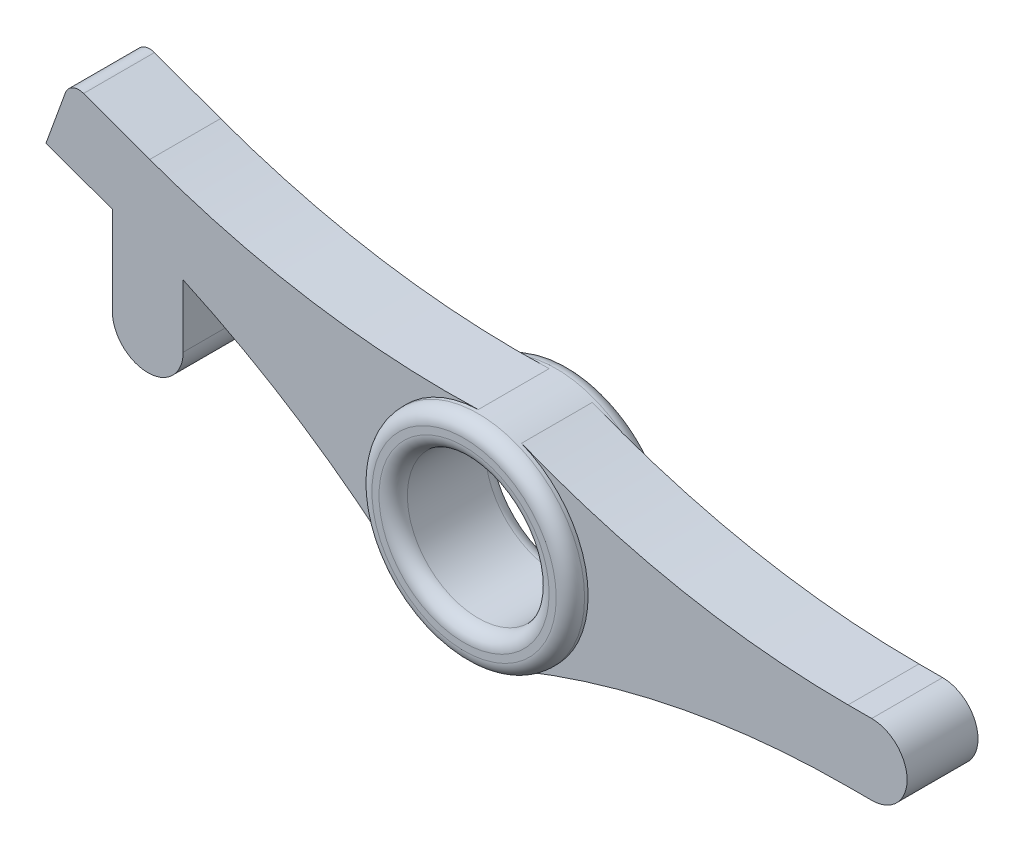
ISO-10303-21;
HEADER;
FILE_DESCRIPTION(('STEP AP214'),'2;1');
FILE_NAME('part.step','',(''),(''),'','','');
FILE_SCHEMA(('AUTOMOTIVE_DESIGN { 1 0 10303 214 1 1 1 1 }'));
ENDSEC;
DATA;
#1=APPLICATION_CONTEXT('core data for automotive mechanical design processes');
#2=APPLICATION_PROTOCOL_DEFINITION('international standard','automotive_design',2000,#1);
#3=PRODUCT_CONTEXT('',#1,'mechanical');
#4=PRODUCT('Part','Part','',(#3));
#5=PRODUCT_RELATED_PRODUCT_CATEGORY('part','',(#4));
#6=PRODUCT_DEFINITION_FORMATION('','',#4);
#7=PRODUCT_DEFINITION_CONTEXT('part definition',#1,'design');
#8=PRODUCT_DEFINITION('design','',#6,#7);
#9=PRODUCT_DEFINITION_SHAPE('','',#8);
#10=(LENGTH_UNIT() NAMED_UNIT(*) SI_UNIT(.MILLI.,.METRE.));
#11=(NAMED_UNIT(*) PLANE_ANGLE_UNIT() SI_UNIT($,.RADIAN.));
#12=(NAMED_UNIT(*) SI_UNIT($,.STERADIAN.) SOLID_ANGLE_UNIT());
#13=UNCERTAINTY_MEASURE_WITH_UNIT(LENGTH_MEASURE(1.E-05),#10,'distance_accuracy_value','');
#14=(GEOMETRIC_REPRESENTATION_CONTEXT(3) GLOBAL_UNCERTAINTY_ASSIGNED_CONTEXT((#13)) GLOBAL_UNIT_ASSIGNED_CONTEXT((#10,
#11,#12)) REPRESENTATION_CONTEXT('',''));
#15=CARTESIAN_POINT('',(0.,0.,0.));
#16=DIRECTION('',(0.,0.,1.));
#17=DIRECTION('',(1.,0.,0.));
#18=AXIS2_PLACEMENT_3D('',#15,#16,#17);
#19=CARTESIAN_POINT('',(55.,0.,5.));
#20=DIRECTION('',(0.,0.,-1.));
#21=DIRECTION('',(-1.,0.,0.));
#22=AXIS2_PLACEMENT_3D('',#19,#20,#21);
#23=CYLINDRICAL_SURFACE('',#22,5.);
#24=DIRECTION('',(0.,0.,1.));
#25=VECTOR('',#24,1.);
#26=CARTESIAN_POINT('',(55.,5.,5.));
#27=LINE('',#26,#25);
#28=CARTESIAN_POINT('',(55.,5.,5.));
#29=VERTEX_POINT('',#28);
#30=CARTESIAN_POINT('',(55.,5.,-5.));
#31=VERTEX_POINT('',#30);
#32=EDGE_CURVE('E170',#29,#31,#27,.F.);
#33=ORIENTED_EDGE('',*,*,#32,.F.);
#34=CARTESIAN_POINT('',(55.,0.,5.));
#35=DIRECTION('',(0.,0.,1.));
#36=DIRECTION('',(1.,0.,0.));
#37=AXIS2_PLACEMENT_3D('',#34,#35,#36);
#38=CIRCLE('',#37,5.);
#39=CARTESIAN_POINT('',(55.,-5.,5.));
#40=VERTEX_POINT('',#39);
#41=EDGE_CURVE('E215',#40,#29,#38,.T.);
#42=ORIENTED_EDGE('',*,*,#41,.F.);
#43=DIRECTION('',(0.,0.,-1.));
#44=VECTOR('',#43,1.);
#45=CARTESIAN_POINT('',(55.,-5.,5.));
#46=LINE('',#45,#44);
#47=CARTESIAN_POINT('',(55.,-5.,-5.));
#48=VERTEX_POINT('',#47);
#49=EDGE_CURVE('E212',#48,#40,#46,.F.);
#50=ORIENTED_EDGE('',*,*,#49,.F.);
#51=CARTESIAN_POINT('',(55.,0.,-5.));
#52=DIRECTION('',(0.,0.,1.));
#53=DIRECTION('',(1.,0.,0.));
#54=AXIS2_PLACEMENT_3D('',#51,#52,#53);
#55=CIRCLE('',#54,5.);
#56=EDGE_CURVE('E218',#31,#48,#55,.F.);
#57=ORIENTED_EDGE('',*,*,#56,.F.);
#58=EDGE_LOOP('',(#33,#42,#50,#57));
#59=FACE_BOUND('',#58,.T.);
#60=ADVANCED_FACE('F39',(#59),#23,.T.);
#61=CARTESIAN_POINT('',(1.71010071662831,4.69846310392955,5.));
#62=DIRECTION('',(-0.342020143325663,-0.93969262078591,0.));
#63=DIRECTION('',(0.939692620785911,-0.342020143325663,0.));
#64=AXIS2_PLACEMENT_3D('',#61,#62,#63);
#65=PLANE('',#64);
#66=DIRECTION('',(-0.939692620785911,0.342020143325663,0.));
#67=VECTOR('',#66,1.);
#68=CARTESIAN_POINT('',(1.71010071662831,4.69846310392955,-5.));
#69=LINE('',#68,#67);
#70=CARTESIAN_POINT('',(-46.8457365386786,22.3713425647349,-5.));
#71=VERTEX_POINT('',#70);
#72=CARTESIAN_POINT('',(-56.1788458498622,25.7683165471584,-5.));
#73=VERTEX_POINT('',#72);
#74=EDGE_CURVE('E187',#71,#73,#69,.T.);
#75=ORIENTED_EDGE('',*,*,#74,.T.);
#76=DIRECTION('',(0.,0.,-1.));
#77=VECTOR('',#76,1.);
#78=CARTESIAN_POINT('',(-56.1788458498622,25.7683165471584,5.));
#79=LINE('',#78,#77);
#80=CARTESIAN_POINT('',(-56.1788458498622,25.7683165471584,5.));
#81=VERTEX_POINT('',#80);
#82=EDGE_CURVE('E47',#73,#81,#79,.F.);
#83=ORIENTED_EDGE('',*,*,#82,.T.);
#84=DIRECTION('',(-0.939692620785911,0.342020143325663,0.));
#85=VECTOR('',#84,1.);
#86=CARTESIAN_POINT('',(1.71010071662831,4.69846310392955,5.));
#87=LINE('',#86,#85);
#88=CARTESIAN_POINT('',(-46.8457365386786,22.3713425647349,5.));
#89=VERTEX_POINT('',#88);
#90=EDGE_CURVE('E161',#89,#81,#87,.T.);
#91=ORIENTED_EDGE('',*,*,#90,.F.);
#92=DIRECTION('',(0.,0.,1.));
#93=VECTOR('',#92,1.);
#94=CARTESIAN_POINT('',(-46.8457365386786,22.3713425647349,-5.));
#95=LINE('',#94,#93);
#96=EDGE_CURVE('E238',#89,#71,#95,.F.);
#97=ORIENTED_EDGE('',*,*,#96,.T.);
#98=EDGE_LOOP('',(#75,#83,#91,#97));
#99=FACE_BOUND('',#98,.T.);
#100=ADVANCED_FACE('F363',(#99),#65,.F.);
#101=CARTESIAN_POINT('',(-59.7683318080624,21.7538937298801,5.));
#102=DIRECTION('',(0.939692620785911,-0.342020143325662,0.));
#103=DIRECTION('',(0.342020143325662,0.939692620785911,0.));
#104=AXIS2_PLACEMENT_3D('',#101,#102,#103);
#105=PLANE('',#104);
#106=DIRECTION('',(-0.342020143325662,-0.939692620785911,0.));
#107=VECTOR('',#106,1.);
#108=CARTESIAN_POINT('',(-59.7683318080624,21.7538937298801,5.));
#109=LINE('',#108,#107);
#110=CARTESIAN_POINT('',(-58.7422713780854,24.5729715922379,5.));
#111=VERTEX_POINT('',#110);
#112=CARTESIAN_POINT('',(-61.4784325246907,17.0554306259506,5.));
#113=VERTEX_POINT('',#112);
#114=EDGE_CURVE('E152',#111,#113,#109,.T.);
#115=ORIENTED_EDGE('',*,*,#114,.F.);
#116=DIRECTION('',(0.,0.,-1.));
#117=VECTOR('',#116,1.);
#118=CARTESIAN_POINT('',(-58.7422713780854,24.5729715922379,5.));
#119=LINE('',#118,#117);
#120=CARTESIAN_POINT('',(-58.7422713780854,24.5729715922379,-5.));
#121=VERTEX_POINT('',#120);
#122=EDGE_CURVE('E285',#111,#121,#119,.T.);
#123=ORIENTED_EDGE('',*,*,#122,.T.);
#124=DIRECTION('',(-0.342020143325662,-0.939692620785911,0.));
#125=VECTOR('',#124,1.);
#126=CARTESIAN_POINT('',(-59.7683318080624,21.7538937298801,-5.));
#127=LINE('',#126,#125);
#128=CARTESIAN_POINT('',(-61.4784325246907,17.0554306259506,-5.));
#129=VERTEX_POINT('',#128);
#130=EDGE_CURVE('E166',#121,#129,#127,.T.);
#131=ORIENTED_EDGE('',*,*,#130,.T.);
#132=DIRECTION('',(0.,0.,-1.));
#133=VECTOR('',#132,1.);
#134=CARTESIAN_POINT('',(-61.4784325246907,17.0554306259506,5.));
#135=LINE('',#134,#133);
#136=EDGE_CURVE('E164',#113,#129,#135,.T.);
#137=ORIENTED_EDGE('',*,*,#136,.F.);
#138=EDGE_LOOP('',(#115,#123,#131,#137));
#139=FACE_BOUND('',#138,.T.);
#140=ADVANCED_FACE('F165',(#139),#105,.F.);
#141=CARTESIAN_POINT('',(-1.71010071662832,-4.69846310392956,5.));
#142=DIRECTION('',(-0.342020143325663,-0.93969262078591,0.));
#143=DIRECTION('',(0.939692620785911,-0.342020143325663,0.));
#144=AXIS2_PLACEMENT_3D('',#141,#142,#143);
#145=PLANE('',#144);
#146=DIRECTION('',(-0.939692620785911,0.342020143325663,0.));
#147=VECTOR('',#146,1.);
#148=CARTESIAN_POINT('',(-1.71010071662832,-4.69846310392956,-5.));
#149=LINE('',#148,#147);
#150=CARTESIAN_POINT('',(-52.12,13.6492397475745,-5.));
#151=VERTEX_POINT('',#150);
#152=EDGE_CURVE('E191',#151,#129,#149,.T.);
#153=ORIENTED_EDGE('',*,*,#152,.F.);
#154=DIRECTION('',(0.,0.,-1.));
#155=VECTOR('',#154,1.);
#156=CARTESIAN_POINT('',(-52.12,13.6492397475745,5.));
#157=LINE('',#156,#155);
#158=CARTESIAN_POINT('',(-52.12,13.6492397475745,5.));
#159=VERTEX_POINT('',#158);
#160=EDGE_CURVE('E171',#159,#151,#157,.T.);
#161=ORIENTED_EDGE('',*,*,#160,.F.);
#162=DIRECTION('',(-0.939692620785911,0.342020143325663,0.));
#163=VECTOR('',#162,1.);
#164=CARTESIAN_POINT('',(-1.71010071662832,-4.69846310392956,5.));
#165=LINE('',#164,#163);
#166=EDGE_CURVE('E156',#159,#113,#165,.T.);
#167=ORIENTED_EDGE('',*,*,#166,.T.);
#168=ORIENTED_EDGE('',*,*,#136,.T.);
#169=EDGE_LOOP('',(#153,#161,#167,#168));
#170=FACE_BOUND('',#169,.T.);
#171=ADVANCED_FACE('F173',(#170),#145,.T.);
#172=CARTESIAN_POINT('',(-52.12,0.,5.));
#173=DIRECTION('',(1.,0.,0.));
#174=DIRECTION('',(0.,1.,0.));
#175=AXIS2_PLACEMENT_3D('',#172,#173,#174);
#176=PLANE('',#175);
#177=DIRECTION('',(0.,-1.,0.));
#178=VECTOR('',#177,1.);
#179=CARTESIAN_POINT('',(-52.12,0.,-5.));
#180=LINE('',#179,#178);
#181=CARTESIAN_POINT('',(-52.12,1.18761085148448,-5.));
#182=VERTEX_POINT('',#181);
#183=EDGE_CURVE('E193',#151,#182,#180,.T.);
#184=ORIENTED_EDGE('',*,*,#183,.T.);
#185=DIRECTION('',(0.,0.,-1.));
#186=VECTOR('',#185,1.);
#187=CARTESIAN_POINT('',(-52.12,1.18761085148448,5.));
#188=LINE('',#187,#186);
#189=CARTESIAN_POINT('',(-52.12,1.18761085148448,5.));
#190=VERTEX_POINT('',#189);
#191=EDGE_CURVE('E206',#190,#182,#188,.T.);
#192=ORIENTED_EDGE('',*,*,#191,.F.);
#193=DIRECTION('',(0.,-1.,0.));
#194=VECTOR('',#193,1.);
#195=CARTESIAN_POINT('',(-52.12,0.,5.));
#196=LINE('',#195,#194);
#197=EDGE_CURVE('E175',#159,#190,#196,.T.);
#198=ORIENTED_EDGE('',*,*,#197,.F.);
#199=ORIENTED_EDGE('',*,*,#160,.T.);
#200=EDGE_LOOP('',(#184,#192,#198,#199));
#201=FACE_BOUND('',#200,.T.);
#202=ADVANCED_FACE('F294',(#201),#176,.F.);
#203=CARTESIAN_POINT('',(-47.12,1.18761085148448,5.));
#204=DIRECTION('',(0.,0.,-1.));
#205=DIRECTION('',(-1.,0.,0.));
#206=AXIS2_PLACEMENT_3D('',#203,#204,#205);
#207=CYLINDRICAL_SURFACE('',#206,5.);
#208=CARTESIAN_POINT('',(-47.12,1.18761085148448,-5.));
#209=DIRECTION('',(0.,0.,1.));
#210=DIRECTION('',(1.,0.,0.));
#211=AXIS2_PLACEMENT_3D('',#208,#209,#210);
#212=CIRCLE('',#211,5.);
#213=CARTESIAN_POINT('',(-42.12,1.18761085148448,-5.));
#214=VERTEX_POINT('',#213);
#215=EDGE_CURVE('E195',#182,#214,#212,.T.);
#216=ORIENTED_EDGE('',*,*,#215,.T.);
#217=DIRECTION('',(0.,0.,-1.));
#218=VECTOR('',#217,1.);
#219=CARTESIAN_POINT('',(-42.12,1.18761085148448,5.));
#220=LINE('',#219,#218);
#221=CARTESIAN_POINT('',(-42.12,1.18761085148448,5.));
#222=VERTEX_POINT('',#221);
#223=EDGE_CURVE('E203',#222,#214,#220,.T.);
#224=ORIENTED_EDGE('',*,*,#223,.F.);
#225=CARTESIAN_POINT('',(-47.12,1.18761085148448,5.));
#226=DIRECTION('',(0.,0.,1.));
#227=DIRECTION('',(1.,0.,0.));
#228=AXIS2_PLACEMENT_3D('',#225,#226,#227);
#229=CIRCLE('',#228,5.);
#230=EDGE_CURVE('E177',#190,#222,#229,.T.);
#231=ORIENTED_EDGE('',*,*,#230,.F.);
#232=ORIENTED_EDGE('',*,*,#191,.T.);
#233=EDGE_LOOP('',(#216,#224,#231,#232));
#234=FACE_BOUND('',#233,.T.);
#235=ADVANCED_FACE('F297',(#234),#207,.T.);
#236=CARTESIAN_POINT('',(-42.12,0.,5.));
#237=DIRECTION('',(-1.,0.,0.));
#238=DIRECTION('',(0.,0.,1.));
#239=AXIS2_PLACEMENT_3D('',#236,#237,#238);
#240=PLANE('',#239);
#241=DIRECTION('',(0.,1.,0.));
#242=VECTOR('',#241,1.);
#243=CARTESIAN_POINT('',(-42.12,0.,-5.));
#244=LINE('',#243,#242);
#245=CARTESIAN_POINT('',(-42.12,10.0095374049126,-5.));
#246=VERTEX_POINT('',#245);
#247=EDGE_CURVE('E197',#214,#246,#244,.T.);
#248=ORIENTED_EDGE('',*,*,#247,.T.);
#249=DIRECTION('',(0.,0.,-1.));
#250=VECTOR('',#249,1.);
#251=CARTESIAN_POINT('',(-42.12,10.0095374049126,5.));
#252=LINE('',#251,#250);
#253=CARTESIAN_POINT('',(-42.12,10.0095374049126,5.));
#254=VERTEX_POINT('',#253);
#255=EDGE_CURVE('E184',#254,#246,#252,.T.);
#256=ORIENTED_EDGE('',*,*,#255,.F.);
#257=DIRECTION('',(0.,1.,0.));
#258=VECTOR('',#257,1.);
#259=CARTESIAN_POINT('',(-42.12,0.,5.));
#260=LINE('',#259,#258);
#261=EDGE_CURVE('E182',#222,#254,#260,.T.);
#262=ORIENTED_EDGE('',*,*,#261,.F.);
#263=ORIENTED_EDGE('',*,*,#223,.T.);
#264=EDGE_LOOP('',(#248,#256,#262,#263));
#265=FACE_BOUND('',#264,.T.);
#266=ADVANCED_FACE('F304',(#265),#240,.F.);
#267=CARTESIAN_POINT('',(0.,0.,5.));
#268=DIRECTION('',(0.,0.,1.));
#269=DIRECTION('',(1.,0.,0.));
#270=AXIS2_PLACEMENT_3D('',#267,#268,#269);
#271=PLANE('',#270);
#272=ORIENTED_EDGE('',*,*,#90,.T.);
#273=CARTESIAN_POINT('',(-56.8628861365135,23.8889313055865,5.));
#274=DIRECTION('',(0.,0.,1.));
#275=DIRECTION('',(1.,0.,0.));
#276=AXIS2_PLACEMENT_3D('',#273,#274,#275);
#277=CIRCLE('',#276,2.);
#278=EDGE_CURVE('E11',#81,#111,#277,.T.);
#279=ORIENTED_EDGE('',*,*,#278,.T.);
#280=ORIENTED_EDGE('',*,*,#114,.T.);
#281=ORIENTED_EDGE('',*,*,#166,.F.);
#282=ORIENTED_EDGE('',*,*,#197,.T.);
#283=ORIENTED_EDGE('',*,*,#230,.T.);
#284=ORIENTED_EDGE('',*,*,#261,.T.);
#285=CARTESIAN_POINT('',(-93.2397446642514,-102.413866321632,5.));
#286=DIRECTION('',(0.,0.,1.));
#287=DIRECTION('',(1.,0.,0.));
#288=AXIS2_PLACEMENT_3D('',#285,#286,#287);
#289=CIRCLE('',#288,123.5);
#290=CARTESIAN_POINT('',(-10.0981672921572,-11.0917544752671,5.));
#291=VERTEX_POINT('',#290);
#292=EDGE_CURVE('E243',#254,#291,#289,.F.);
#293=ORIENTED_EDGE('',*,*,#292,.T.);
#294=CARTESIAN_POINT('',(0.,0.,5.));
#295=DIRECTION('',(0.,0.,1.));
#296=DIRECTION('',(1.,0.,0.));
#297=AXIS2_PLACEMENT_3D('',#294,#295,#296);
#298=CIRCLE('',#297,15.);
#299=CARTESIAN_POINT('',(-0.498871715302452,14.9917019384615,5.));
#300=VERTEX_POINT('',#299);
#301=EDGE_CURVE('E200',#300,#291,#298,.T.);
#302=ORIENTED_EDGE('',*,*,#301,.F.);
#303=CARTESIAN_POINT('',(-4.60624883795931,138.423381231795,5.));
#304=DIRECTION('',(0.,0.,1.));
#305=DIRECTION('',(1.,0.,0.));
#306=AXIS2_PLACEMENT_3D('',#303,#304,#305);
#307=CIRCLE('',#306,123.5);
#308=EDGE_CURVE('E259',#300,#89,#307,.F.);
#309=ORIENTED_EDGE('',*,*,#308,.T.);
#310=EDGE_LOOP('',(#272,#279,#280,#281,#282,#283,#284,#293,#302,#309));
#311=FACE_BOUND('',#310,.T.);
#312=ADVANCED_FACE('F154',(#311),#271,.T.);
#313=CARTESIAN_POINT('',(0.,0.,-5.));
#314=DIRECTION('',(0.,0.,1.));
#315=DIRECTION('',(1.,0.,0.));
#316=AXIS2_PLACEMENT_3D('',#313,#314,#315);
#317=PLANE('',#316);
#318=ORIENTED_EDGE('',*,*,#130,.F.);
#319=CARTESIAN_POINT('',(-56.8628861365135,23.8889313055865,-5.));
#320=DIRECTION('',(0.,0.,1.));
#321=DIRECTION('',(1.,0.,0.));
#322=AXIS2_PLACEMENT_3D('',#319,#320,#321);
#323=CIRCLE('',#322,2.);
#324=EDGE_CURVE('E61',#121,#73,#323,.F.);
#325=ORIENTED_EDGE('',*,*,#324,.T.);
#326=ORIENTED_EDGE('',*,*,#74,.F.);
#327=CARTESIAN_POINT('',(-4.60624883795931,138.423381231795,-5.));
#328=DIRECTION('',(0.,0.,1.));
#329=DIRECTION('',(1.,0.,0.));
#330=AXIS2_PLACEMENT_3D('',#327,#328,#329);
#331=CIRCLE('',#330,123.5);
#332=CARTESIAN_POINT('',(-0.498871715302452,14.9917019384615,-5.));
#333=VERTEX_POINT('',#332);
#334=EDGE_CURVE('E256',#71,#333,#331,.T.);
#335=ORIENTED_EDGE('',*,*,#334,.T.);
#336=CARTESIAN_POINT('',(0.,0.,-5.));
#337=DIRECTION('',(0.,0.,1.));
#338=DIRECTION('',(1.,0.,0.));
#339=AXIS2_PLACEMENT_3D('',#336,#337,#338);
#340=CIRCLE('',#339,15.);
#341=CARTESIAN_POINT('',(-10.0981672921572,-11.0917544752671,-5.));
#342=VERTEX_POINT('',#341);
#343=EDGE_CURVE('E185',#333,#342,#340,.T.);
#344=ORIENTED_EDGE('',*,*,#343,.T.);
#345=CARTESIAN_POINT('',(-93.2397446642514,-102.413866321632,-5.));
#346=DIRECTION('',(0.,0.,1.));
#347=DIRECTION('',(1.,0.,0.));
#348=AXIS2_PLACEMENT_3D('',#345,#346,#347);
#349=CIRCLE('',#348,123.5);
#350=EDGE_CURVE('E241',#342,#246,#349,.T.);
#351=ORIENTED_EDGE('',*,*,#350,.T.);
#352=ORIENTED_EDGE('',*,*,#247,.F.);
#353=ORIENTED_EDGE('',*,*,#215,.F.);
#354=ORIENTED_EDGE('',*,*,#183,.F.);
#355=ORIENTED_EDGE('',*,*,#152,.T.);
#356=EDGE_LOOP('',(#318,#325,#326,#335,#344,#351,#352,#353,#354,#355));
#357=FACE_BOUND('',#356,.T.);
#358=ADVANCED_FACE('F288',(#357),#317,.F.);
#359=CARTESIAN_POINT('',(0.,0.,7.5));
#360=DIRECTION('',(0.,0.,-1.));
#361=DIRECTION('',(-1.,0.,0.));
#362=AXIS2_PLACEMENT_3D('',#359,#360,#361);
#363=CYLINDRICAL_SURFACE('',#362,10.);
#364=CARTESIAN_POINT('',(0.,0.,-5.5));
#365=DIRECTION('',(0.,0.,1.));
#366=DIRECTION('',(1.,0.,0.));
#367=AXIS2_PLACEMENT_3D('',#364,#365,#366);
#368=CIRCLE('',#367,10.);
#369=CARTESIAN_POINT('',(10.,0.,-5.5));
#370=VERTEX_POINT('',#369);
#371=EDGE_CURVE('E270',#370,#370,#368,.F.);
#372=ORIENTED_EDGE('',*,*,#371,.T.);
#373=EDGE_LOOP('',(#372));
#374=FACE_BOUND('',#373,.T.);
#375=CARTESIAN_POINT('',(0.,0.,5.5));
#376=DIRECTION('',(0.,0.,1.));
#377=DIRECTION('',(1.,0.,0.));
#378=AXIS2_PLACEMENT_3D('',#375,#376,#377);
#379=CIRCLE('',#378,10.);
#380=CARTESIAN_POINT('',(10.,0.,5.5));
#381=VERTEX_POINT('',#380);
#382=EDGE_CURVE('E267',#381,#381,#379,.T.);
#383=ORIENTED_EDGE('',*,*,#382,.T.);
#384=EDGE_LOOP('',(#383));
#385=FACE_BOUND('',#384,.T.);
#386=ADVANCED_FACE('F385',(#374,#385),#363,.F.);
#387=CARTESIAN_POINT('',(0.,0.,7.5));
#388=DIRECTION('',(0.,0.,-1.));
#389=DIRECTION('',(-1.,0.,0.));
#390=AXIS2_PLACEMENT_3D('',#387,#388,#389);
#391=CYLINDRICAL_SURFACE('',#390,15.);
#392=CARTESIAN_POINT('',(0.,0.,-5.5));
#393=DIRECTION('',(0.,0.,1.));
#394=DIRECTION('',(1.,0.,0.));
#395=AXIS2_PLACEMENT_3D('',#392,#393,#394);
#396=CIRCLE('',#395,15.);
#397=CARTESIAN_POINT('',(15.,0.,-5.5));
#398=VERTEX_POINT('',#397);
#399=EDGE_CURVE('E276',#398,#398,#396,.T.);
#400=ORIENTED_EDGE('',*,*,#399,.T.);
#401=EDGE_LOOP('',(#400));
#402=FACE_BOUND('',#401,.T.);
#403=CARTESIAN_POINT('',(0.,0.,5.5));
#404=DIRECTION('',(0.,0.,1.));
#405=DIRECTION('',(1.,0.,0.));
#406=AXIS2_PLACEMENT_3D('',#403,#404,#405);
#407=CIRCLE('',#406,15.);
#408=CARTESIAN_POINT('',(15.,0.,5.5));
#409=VERTEX_POINT('',#408);
#410=EDGE_CURVE('E273',#409,#409,#407,.F.);
#411=ORIENTED_EDGE('',*,*,#410,.T.);
#412=EDGE_LOOP('',(#411));
#413=FACE_BOUND('',#412,.T.);
#414=CARTESIAN_POINT('',(0.,0.,-5.));
#415=DIRECTION('',(0.,0.,1.));
#416=DIRECTION('',(1.,0.,0.));
#417=AXIS2_PLACEMENT_3D('',#414,#415,#416);
#418=CIRCLE('',#417,15.);
#419=CARTESIAN_POINT('',(5.59625011527674,-13.9169675090253,-5.));
#420=VERTEX_POINT('',#419);
#421=CARTESIAN_POINT('',(5.59625011527674,13.9169675090253,-5.));
#422=VERTEX_POINT('',#421);
#423=EDGE_CURVE('E319',#420,#422,#418,.T.);
#424=ORIENTED_EDGE('',*,*,#423,.F.);
#425=DIRECTION('',(0.,0.,-1.));
#426=VECTOR('',#425,1.);
#427=CARTESIAN_POINT('',(5.59625011527674,-13.9169675090253,7.5));
#428=LINE('',#427,#426);
#429=CARTESIAN_POINT('',(5.59625011527674,-13.9169675090253,5.));
#430=VERTEX_POINT('',#429);
#431=EDGE_CURVE('E227',#420,#430,#428,.F.);
#432=ORIENTED_EDGE('',*,*,#431,.T.);
#433=CARTESIAN_POINT('',(0.,0.,5.));
#434=DIRECTION('',(0.,0.,1.));
#435=DIRECTION('',(1.,0.,0.));
#436=AXIS2_PLACEMENT_3D('',#433,#434,#435);
#437=CIRCLE('',#436,15.);
#438=CARTESIAN_POINT('',(5.59625011527674,13.9169675090253,5.));
#439=VERTEX_POINT('',#438);
#440=EDGE_CURVE('E316',#430,#439,#437,.T.);
#441=ORIENTED_EDGE('',*,*,#440,.T.);
#442=DIRECTION('',(0.,0.,-1.));
#443=VECTOR('',#442,1.);
#444=CARTESIAN_POINT('',(5.59625011527674,13.9169675090253,7.5));
#445=LINE('',#444,#443);
#446=EDGE_CURVE('E224',#439,#422,#445,.T.);
#447=ORIENTED_EDGE('',*,*,#446,.T.);
#448=EDGE_LOOP('',(#424,#432,#441,#447));
#449=FACE_BOUND('',#448,.T.);
#450=DIRECTION('',(0.,0.,-1.));
#451=VECTOR('',#450,1.);
#452=CARTESIAN_POINT('',(-10.0981672921572,-11.0917544752671,7.5));
#453=LINE('',#452,#451);
#454=EDGE_CURVE('E230',#291,#342,#453,.T.);
#455=ORIENTED_EDGE('',*,*,#454,.T.);
#456=ORIENTED_EDGE('',*,*,#343,.F.);
#457=DIRECTION('',(0.,0.,-1.));
#458=VECTOR('',#457,1.);
#459=CARTESIAN_POINT('',(-0.498871715302452,14.9917019384615,7.5));
#460=LINE('',#459,#458);
#461=EDGE_CURVE('E221',#333,#300,#460,.F.);
#462=ORIENTED_EDGE('',*,*,#461,.T.);
#463=ORIENTED_EDGE('',*,*,#301,.T.);
#464=EDGE_LOOP('',(#455,#456,#462,#463));
#465=FACE_BOUND('',#464,.T.);
#466=ADVANCED_FACE('F309',(#402,#413,#449,#465),#391,.T.);
#467=CARTESIAN_POINT('',(0.,0.,7.5));
#468=DIRECTION('',(0.,0.,1.));
#469=DIRECTION('',(1.,0.,0.));
#470=AXIS2_PLACEMENT_3D('',#467,#468,#469);
#471=PLANE('',#470);
#472=CARTESIAN_POINT('',(0.,0.,7.5));
#473=DIRECTION('',(0.,0.,1.));
#474=DIRECTION('',(1.,0.,0.));
#475=AXIS2_PLACEMENT_3D('',#472,#473,#474);
#476=CIRCLE('',#475,12.);
#477=CARTESIAN_POINT('',(12.,0.,7.5));
#478=VERTEX_POINT('',#477);
#479=EDGE_CURVE('E282',#478,#478,#476,.F.);
#480=ORIENTED_EDGE('',*,*,#479,.T.);
#481=EDGE_LOOP('',(#480));
#482=FACE_BOUND('',#481,.T.);
#483=CARTESIAN_POINT('',(0.,0.,7.5));
#484=DIRECTION('',(0.,0.,1.));
#485=DIRECTION('',(1.,0.,0.));
#486=AXIS2_PLACEMENT_3D('',#483,#484,#485);
#487=CIRCLE('',#486,13.);
#488=CARTESIAN_POINT('',(13.,0.,7.5));
#489=VERTEX_POINT('',#488);
#490=EDGE_CURVE('E279',#489,#489,#487,.T.);
#491=ORIENTED_EDGE('',*,*,#490,.T.);
#492=EDGE_LOOP('',(#491));
#493=FACE_BOUND('',#492,.T.);
#494=ADVANCED_FACE('F393',(#482,#493),#471,.T.);
#495=CARTESIAN_POINT('',(0.,0.,-7.5));
#496=DIRECTION('',(0.,0.,1.));
#497=DIRECTION('',(1.,0.,0.));
#498=AXIS2_PLACEMENT_3D('',#495,#496,#497);
#499=PLANE('',#498);
#500=CARTESIAN_POINT('',(0.,0.,-7.5));
#501=DIRECTION('',(0.,0.,1.));
#502=DIRECTION('',(1.,0.,0.));
#503=AXIS2_PLACEMENT_3D('',#500,#501,#502);
#504=CIRCLE('',#503,12.);
#505=CARTESIAN_POINT('',(12.,0.,-7.5));
#506=VERTEX_POINT('',#505);
#507=EDGE_CURVE('E264',#506,#506,#504,.T.);
#508=ORIENTED_EDGE('',*,*,#507,.T.);
#509=EDGE_LOOP('',(#508));
#510=FACE_BOUND('',#509,.T.);
#511=CARTESIAN_POINT('',(0.,0.,-7.5));
#512=DIRECTION('',(0.,0.,1.));
#513=DIRECTION('',(1.,0.,0.));
#514=AXIS2_PLACEMENT_3D('',#511,#512,#513);
#515=CIRCLE('',#514,13.);
#516=CARTESIAN_POINT('',(13.,0.,-7.5));
#517=VERTEX_POINT('',#516);
#518=EDGE_CURVE('E261',#517,#517,#515,.F.);
#519=ORIENTED_EDGE('',*,*,#518,.T.);
#520=EDGE_LOOP('',(#519));
#521=FACE_BOUND('',#520,.T.);
#522=ADVANCED_FACE('F395',(#510,#521),#499,.F.);
#523=CARTESIAN_POINT('',(0.,-5.,5.));
#524=DIRECTION('',(0.,1.,0.));
#525=DIRECTION('',(0.,0.,1.));
#526=AXIS2_PLACEMENT_3D('',#523,#524,#525);
#527=PLANE('',#526);
#528=DIRECTION('',(1.,0.,0.));
#529=VECTOR('',#528,1.);
#530=CARTESIAN_POINT('',(0.,-5.,5.));
#531=LINE('',#530,#529);
#532=CARTESIAN_POINT('',(51.6720427310552,-5.,5.));
#533=VERTEX_POINT('',#532);
#534=EDGE_CURVE('E322',#533,#40,#531,.T.);
#535=ORIENTED_EDGE('',*,*,#534,.F.);
#536=DIRECTION('',(0.,0.,1.));
#537=VECTOR('',#536,1.);
#538=CARTESIAN_POINT('',(51.6720427310552,-5.,-5.));
#539=LINE('',#538,#537);
#540=CARTESIAN_POINT('',(51.6720427310552,-5.,-5.));
#541=VERTEX_POINT('',#540);
#542=EDGE_CURVE('E233',#533,#541,#539,.F.);
#543=ORIENTED_EDGE('',*,*,#542,.T.);
#544=DIRECTION('',(1.,0.,0.));
#545=VECTOR('',#544,1.);
#546=CARTESIAN_POINT('',(0.,-5.,-5.));
#547=LINE('',#546,#545);
#548=EDGE_CURVE('E317',#541,#48,#547,.T.);
#549=ORIENTED_EDGE('',*,*,#548,.T.);
#550=ORIENTED_EDGE('',*,*,#49,.T.);
#551=EDGE_LOOP('',(#535,#543,#549,#550));
#552=FACE_BOUND('',#551,.T.);
#553=ADVANCED_FACE('F349',(#552),#527,.F.);
#554=CARTESIAN_POINT('',(0.,5.,5.));
#555=DIRECTION('',(0.,1.,0.));
#556=DIRECTION('',(0.,0.,1.));
#557=AXIS2_PLACEMENT_3D('',#554,#555,#556);
#558=PLANE('',#557);
#559=DIRECTION('',(1.,0.,0.));
#560=VECTOR('',#559,1.);
#561=CARTESIAN_POINT('',(0.,5.,-5.));
#562=LINE('',#561,#560);
#563=CARTESIAN_POINT('',(51.6720427310552,5.,-5.));
#564=VERTEX_POINT('',#563);
#565=EDGE_CURVE('E314',#564,#31,#562,.T.);
#566=ORIENTED_EDGE('',*,*,#565,.F.);
#567=DIRECTION('',(0.,0.,-1.));
#568=VECTOR('',#567,1.);
#569=CARTESIAN_POINT('',(51.6720427310552,5.,5.));
#570=LINE('',#569,#568);
#571=CARTESIAN_POINT('',(51.6720427310552,5.,5.));
#572=VERTEX_POINT('',#571);
#573=EDGE_CURVE('E236',#564,#572,#570,.F.);
#574=ORIENTED_EDGE('',*,*,#573,.T.);
#575=DIRECTION('',(1.,0.,0.));
#576=VECTOR('',#575,1.);
#577=CARTESIAN_POINT('',(0.,5.,5.));
#578=LINE('',#577,#576);
#579=EDGE_CURVE('E188',#572,#29,#578,.T.);
#580=ORIENTED_EDGE('',*,*,#579,.T.);
#581=ORIENTED_EDGE('',*,*,#32,.T.);
#582=EDGE_LOOP('',(#566,#574,#580,#581));
#583=FACE_BOUND('',#582,.T.);
#584=ADVANCED_FACE('F341',(#583),#558,.T.);
#585=CARTESIAN_POINT('',(0.,0.,5.));
#586=DIRECTION('',(0.,0.,1.));
#587=DIRECTION('',(1.,0.,0.));
#588=AXIS2_PLACEMENT_3D('',#585,#586,#587);
#589=PLANE('',#588);
#590=ORIENTED_EDGE('',*,*,#440,.F.);
#591=CARTESIAN_POINT('',(51.6720427310552,-128.5,5.));
#592=DIRECTION('',(0.,0.,1.));
#593=DIRECTION('',(1.,0.,0.));
#594=AXIS2_PLACEMENT_3D('',#591,#592,#593);
#595=CIRCLE('',#594,123.5);
#596=EDGE_CURVE('E249',#430,#533,#595,.F.);
#597=ORIENTED_EDGE('',*,*,#596,.T.);
#598=ORIENTED_EDGE('',*,*,#534,.T.);
#599=ORIENTED_EDGE('',*,*,#41,.T.);
#600=ORIENTED_EDGE('',*,*,#579,.F.);
#601=CARTESIAN_POINT('',(51.6720427310552,128.5,5.));
#602=DIRECTION('',(0.,0.,1.));
#603=DIRECTION('',(1.,0.,0.));
#604=AXIS2_PLACEMENT_3D('',#601,#602,#603);
#605=CIRCLE('',#604,123.5);
#606=EDGE_CURVE('E253',#572,#439,#605,.F.);
#607=ORIENTED_EDGE('',*,*,#606,.T.);
#608=EDGE_LOOP('',(#590,#597,#598,#599,#600,#607));
#609=FACE_BOUND('',#608,.T.);
#610=ADVANCED_FACE('F331',(#609),#589,.T.);
#611=CARTESIAN_POINT('',(0.,0.,-5.));
#612=DIRECTION('',(0.,0.,1.));
#613=DIRECTION('',(1.,0.,0.));
#614=AXIS2_PLACEMENT_3D('',#611,#612,#613);
#615=PLANE('',#614);
#616=ORIENTED_EDGE('',*,*,#423,.T.);
#617=CARTESIAN_POINT('',(51.6720427310552,128.5,-5.));
#618=DIRECTION('',(0.,0.,1.));
#619=DIRECTION('',(1.,0.,0.));
#620=AXIS2_PLACEMENT_3D('',#617,#618,#619);
#621=CIRCLE('',#620,123.5);
#622=EDGE_CURVE('E251',#422,#564,#621,.T.);
#623=ORIENTED_EDGE('',*,*,#622,.T.);
#624=ORIENTED_EDGE('',*,*,#565,.T.);
#625=ORIENTED_EDGE('',*,*,#56,.T.);
#626=ORIENTED_EDGE('',*,*,#548,.F.);
#627=CARTESIAN_POINT('',(51.6720427310552,-128.5,-5.));
#628=DIRECTION('',(0.,0.,1.));
#629=DIRECTION('',(1.,0.,0.));
#630=AXIS2_PLACEMENT_3D('',#627,#628,#629);
#631=CIRCLE('',#630,123.5);
#632=EDGE_CURVE('E246',#541,#420,#631,.T.);
#633=ORIENTED_EDGE('',*,*,#632,.T.);
#634=EDGE_LOOP('',(#616,#623,#624,#625,#626,#633));
#635=FACE_BOUND('',#634,.T.);
#636=ADVANCED_FACE('F338',(#635),#615,.F.);
#637=CARTESIAN_POINT('',(-93.2397446642514,-102.413866321632,5.));
#638=DIRECTION('',(0.,0.,1.));
#639=DIRECTION('',(1.,0.,0.));
#640=AXIS2_PLACEMENT_3D('',#637,#638,#639);
#641=CYLINDRICAL_SURFACE('',#640,123.5);
#642=ORIENTED_EDGE('',*,*,#292,.F.);
#643=ORIENTED_EDGE('',*,*,#255,.T.);
#644=ORIENTED_EDGE('',*,*,#350,.F.);
#645=ORIENTED_EDGE('',*,*,#454,.F.);
#646=EDGE_LOOP('',(#642,#643,#644,#645));
#647=FACE_BOUND('',#646,.T.);
#648=ADVANCED_FACE('F307',(#647),#641,.F.);
#649=CARTESIAN_POINT('',(51.6720427310552,-128.5,7.5));
#650=DIRECTION('',(0.,0.,-1.));
#651=DIRECTION('',(-1.,0.,0.));
#652=AXIS2_PLACEMENT_3D('',#649,#650,#651);
#653=CYLINDRICAL_SURFACE('',#652,123.5);
#654=ORIENTED_EDGE('',*,*,#596,.F.);
#655=ORIENTED_EDGE('',*,*,#431,.F.);
#656=ORIENTED_EDGE('',*,*,#632,.F.);
#657=ORIENTED_EDGE('',*,*,#542,.F.);
#658=EDGE_LOOP('',(#654,#655,#656,#657));
#659=FACE_BOUND('',#658,.T.);
#660=ADVANCED_FACE('F352',(#659),#653,.F.);
#661=CARTESIAN_POINT('',(51.6720427310552,128.5,7.5));
#662=DIRECTION('',(0.,0.,-1.));
#663=DIRECTION('',(-1.,0.,0.));
#664=AXIS2_PLACEMENT_3D('',#661,#662,#663);
#665=CYLINDRICAL_SURFACE('',#664,123.5);
#666=ORIENTED_EDGE('',*,*,#606,.F.);
#667=ORIENTED_EDGE('',*,*,#573,.F.);
#668=ORIENTED_EDGE('',*,*,#622,.F.);
#669=ORIENTED_EDGE('',*,*,#446,.F.);
#670=EDGE_LOOP('',(#666,#667,#668,#669));
#671=FACE_BOUND('',#670,.T.);
#672=ADVANCED_FACE('F335',(#671),#665,.F.);
#673=CARTESIAN_POINT('',(-4.60624883795931,138.423381231795,7.5));
#674=DIRECTION('',(0.,0.,-1.));
#675=DIRECTION('',(-1.,0.,0.));
#676=AXIS2_PLACEMENT_3D('',#673,#674,#675);
#677=CYLINDRICAL_SURFACE('',#676,123.5);
#678=ORIENTED_EDGE('',*,*,#308,.F.);
#679=ORIENTED_EDGE('',*,*,#461,.F.);
#680=ORIENTED_EDGE('',*,*,#334,.F.);
#681=ORIENTED_EDGE('',*,*,#96,.F.);
#682=EDGE_LOOP('',(#678,#679,#680,#681));
#683=FACE_BOUND('',#682,.T.);
#684=ADVANCED_FACE('F359',(#683),#677,.F.);
#685=CARTESIAN_POINT('',(0.,0.,-5.5));
#686=DIRECTION('',(0.,0.,1.));
#687=DIRECTION('',(1.,0.,0.));
#688=AXIS2_PLACEMENT_3D('',#685,#686,#687);
#689=TOROIDAL_SURFACE('',#688,12.,2.);
#690=ORIENTED_EDGE('',*,*,#371,.F.);
#691=EDGE_LOOP('',(#690));
#692=FACE_BOUND('',#691,.T.);
#693=ORIENTED_EDGE('',*,*,#507,.F.);
#694=EDGE_LOOP('',(#693));
#695=FACE_BOUND('',#694,.T.);
#696=ADVANCED_FACE('F441',(#692,#695),#689,.T.);
#697=CARTESIAN_POINT('',(0.,0.,-5.5));
#698=DIRECTION('',(0.,0.,1.));
#699=DIRECTION('',(1.,0.,0.));
#700=AXIS2_PLACEMENT_3D('',#697,#698,#699);
#701=TOROIDAL_SURFACE('',#700,13.,2.);
#702=ORIENTED_EDGE('',*,*,#518,.F.);
#703=EDGE_LOOP('',(#702));
#704=FACE_BOUND('',#703,.T.);
#705=ORIENTED_EDGE('',*,*,#399,.F.);
#706=EDGE_LOOP('',(#705));
#707=FACE_BOUND('',#706,.T.);
#708=ADVANCED_FACE('F475',(#704,#707),#701,.T.);
#709=CARTESIAN_POINT('',(0.,0.,5.5));
#710=DIRECTION('',(0.,0.,1.));
#711=DIRECTION('',(1.,0.,0.));
#712=AXIS2_PLACEMENT_3D('',#709,#710,#711);
#713=TOROIDAL_SURFACE('',#712,12.,2.);
#714=ORIENTED_EDGE('',*,*,#479,.F.);
#715=EDGE_LOOP('',(#714));
#716=FACE_BOUND('',#715,.T.);
#717=ORIENTED_EDGE('',*,*,#382,.F.);
#718=EDGE_LOOP('',(#717));
#719=FACE_BOUND('',#718,.T.);
#720=ADVANCED_FACE('F485',(#716,#719),#713,.T.);
#721=CARTESIAN_POINT('',(0.,0.,5.5));
#722=DIRECTION('',(0.,0.,1.));
#723=DIRECTION('',(1.,0.,0.));
#724=AXIS2_PLACEMENT_3D('',#721,#722,#723);
#725=TOROIDAL_SURFACE('',#724,13.,2.);
#726=ORIENTED_EDGE('',*,*,#410,.F.);
#727=EDGE_LOOP('',(#726));
#728=FACE_BOUND('',#727,.T.);
#729=ORIENTED_EDGE('',*,*,#490,.F.);
#730=EDGE_LOOP('',(#729));
#731=FACE_BOUND('',#730,.T.);
#732=ADVANCED_FACE('F495',(#728,#731),#725,.T.);
#733=CARTESIAN_POINT('',(-56.8628861365135,23.8889313055865,5.));
#734=DIRECTION('',(0.,0.,-1.));
#735=DIRECTION('',(-1.,0.,0.));
#736=AXIS2_PLACEMENT_3D('',#733,#734,#735);
#737=CYLINDRICAL_SURFACE('',#736,2.);
#738=ORIENTED_EDGE('',*,*,#278,.F.);
#739=ORIENTED_EDGE('',*,*,#82,.F.);
#740=ORIENTED_EDGE('',*,*,#324,.F.);
#741=ORIENTED_EDGE('',*,*,#122,.F.);
#742=EDGE_LOOP('',(#738,#739,#740,#741));
#743=FACE_BOUND('',#742,.T.);
#744=ADVANCED_FACE('F41',(#743),#737,.T.);
#745=CLOSED_SHELL('',(#60,#100,#140,#171,#202,#235,#266,#312,#358,#386,#466,#494,#522,#553,#584,
#610,#636,#648,#660,#672,#684,#696,#708,#720,#732,#744));
#746=MANIFOLD_SOLID_BREP('B2',#745);
#747=ADVANCED_BREP_SHAPE_REPRESENTATION('',(#18,#746),#14);
#748=SHAPE_DEFINITION_REPRESENTATION(#9,#747);
ENDSEC;
END-ISO-10303-21;
